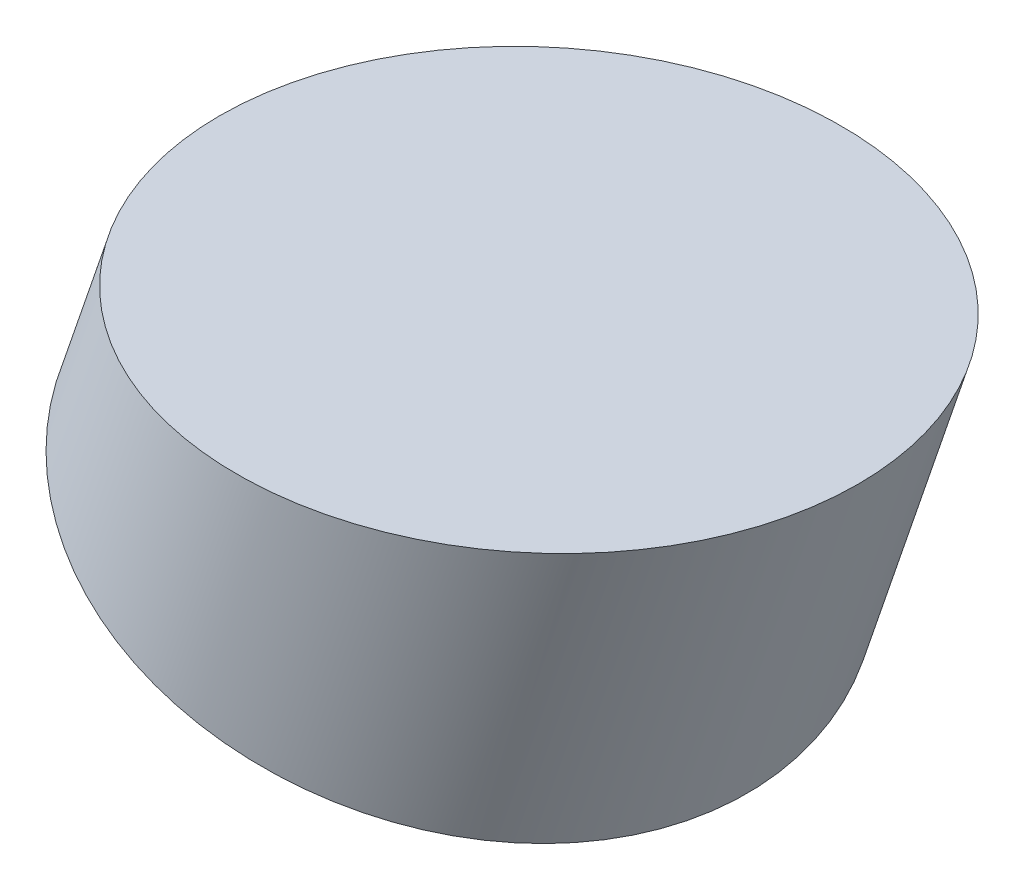
ISO-10303-21;
HEADER;
FILE_DESCRIPTION(('STEP AP214'),'2;1');
FILE_NAME('part.step','',(''),(''),'','','');
FILE_SCHEMA(('AUTOMOTIVE_DESIGN { 1 0 10303 214 1 1 1 1 }'));
ENDSEC;
DATA;
#1=APPLICATION_CONTEXT('core data for automotive mechanical design processes');
#2=APPLICATION_PROTOCOL_DEFINITION('international standard','automotive_design',2000,#1);
#3=PRODUCT_CONTEXT('',#1,'mechanical');
#4=PRODUCT('Part','Part','',(#3));
#5=PRODUCT_RELATED_PRODUCT_CATEGORY('part','',(#4));
#6=PRODUCT_DEFINITION_FORMATION('','',#4);
#7=PRODUCT_DEFINITION_CONTEXT('part definition',#1,'design');
#8=PRODUCT_DEFINITION('design','',#6,#7);
#9=PRODUCT_DEFINITION_SHAPE('','',#8);
#10=(LENGTH_UNIT() NAMED_UNIT(*) SI_UNIT(.MILLI.,.METRE.));
#11=(NAMED_UNIT(*) PLANE_ANGLE_UNIT() SI_UNIT($,.RADIAN.));
#12=(NAMED_UNIT(*) SI_UNIT($,.STERADIAN.) SOLID_ANGLE_UNIT());
#13=UNCERTAINTY_MEASURE_WITH_UNIT(LENGTH_MEASURE(1.E-05),#10,'distance_accuracy_value','');
#14=(GEOMETRIC_REPRESENTATION_CONTEXT(3) GLOBAL_UNCERTAINTY_ASSIGNED_CONTEXT((#13)) GLOBAL_UNIT_ASSIGNED_CONTEXT((#10,
#11,#12)) REPRESENTATION_CONTEXT('',''));
#15=CARTESIAN_POINT('',(0.,0.,0.));
#16=DIRECTION('',(0.,0.,1.));
#17=DIRECTION('',(1.,0.,0.));
#18=AXIS2_PLACEMENT_3D('',#15,#16,#17);
#19=CARTESIAN_POINT('',(10.1950896070225,30.0358760489147,34.5392569214431));
#20=DIRECTION('',(-0.324788767222684,-0.945786580939891,0.));
#21=DIRECTION('',(0.945786580939891,-0.324788767222684,0.));
#22=AXIS2_PLACEMENT_3D('',#19,#20,#21);
#23=CYLINDRICAL_SURFACE('',#22,9.65);
#24=CARTESIAN_POINT('',(6.17264753358172,18.3225037910005,34.5392569214431));
#25=DIRECTION('',(0.,-1.,0.));
#26=DIRECTION('',(-1.,0.,0.));
#27=AXIS2_PLACEMENT_3D('',#24,#25,#26);
#28=ELLIPSE('',#27,10.2031475117887,9.65);
#29=CARTESIAN_POINT('',(-4.03049997820699,18.3225037910005,34.5392569214431));
#30=VERTEX_POINT('',#29);
#31=EDGE_CURVE('E35',#30,#30,#28,.T.);
#32=ORIENTED_EDGE('',*,*,#31,.T.);
#33=EDGE_LOOP('',(#32));
#34=FACE_BOUND('',#33,.T.);
#35=CARTESIAN_POINT('',(3.69931426256884,11.1201444301168,34.5392569214431));
#36=DIRECTION('',(0.324788767222684,0.945786580939891,0.));
#37=DIRECTION('',(-0.945786580939891,0.324788767222684,0.));
#38=AXIS2_PLACEMENT_3D('',#35,#36,#37);
#39=CIRCLE('',#38,9.65);
#40=CARTESIAN_POINT('',(-5.42752624350112,14.2543560338157,34.5392569214431));
#41=VERTEX_POINT('',#40);
#42=EDGE_CURVE('E10',#41,#41,#39,.T.);
#43=ORIENTED_EDGE('',*,*,#42,.T.);
#44=EDGE_LOOP('',(#43));
#45=FACE_BOUND('',#44,.T.);
#46=ADVANCED_FACE('F32',(#34,#45),#23,.T.);
#47=CARTESIAN_POINT('',(3.69931426256884,11.1201444301168,34.5392569214431));
#48=DIRECTION('',(0.324788767222684,0.945786580939891,0.));
#49=DIRECTION('',(-0.945786580939891,0.324788767222684,0.));
#50=AXIS2_PLACEMENT_3D('',#47,#48,#49);
#51=PLANE('',#50);
#52=ORIENTED_EDGE('',*,*,#42,.F.);
#53=EDGE_LOOP('',(#52));
#54=FACE_BOUND('',#53,.T.);
#55=ADVANCED_FACE('F47',(#54),#51,.F.);
#56=CARTESIAN_POINT('',(-7.41598830447177,18.3225037910005,20.0392569214431));
#57=DIRECTION('',(0.,-1.,0.));
#58=DIRECTION('',(0.,0.,-1.));
#59=AXIS2_PLACEMENT_3D('',#56,#57,#58);
#60=PLANE('',#59);
#61=ORIENTED_EDGE('',*,*,#31,.F.);
#62=EDGE_LOOP('',(#61));
#63=FACE_BOUND('',#62,.T.);
#64=ADVANCED_FACE('F45',(#63),#60,.F.);
#65=CLOSED_SHELL('',(#46,#55,#64));
#66=MANIFOLD_SOLID_BREP('B2',#65);
#67=ADVANCED_BREP_SHAPE_REPRESENTATION('',(#18,#66),#14);
#68=SHAPE_DEFINITION_REPRESENTATION(#9,#67);
ENDSEC;
END-ISO-10303-21;
